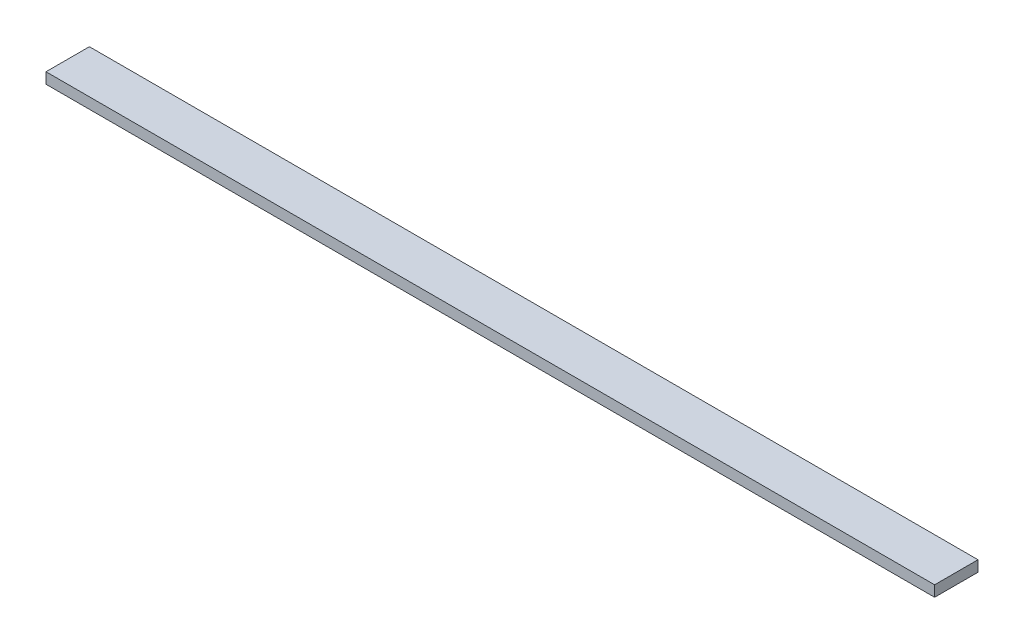
ISO-10303-21;
HEADER;
FILE_DESCRIPTION(('STEP AP214'),'2;1');
FILE_NAME('part.step','',(''),(''),'','','');
FILE_SCHEMA(('AUTOMOTIVE_DESIGN { 1 0 10303 214 1 1 1 1 }'));
ENDSEC;
DATA;
#1=APPLICATION_CONTEXT('core data for automotive mechanical design processes');
#2=APPLICATION_PROTOCOL_DEFINITION('international standard','automotive_design',2000,#1);
#3=PRODUCT_CONTEXT('',#1,'mechanical');
#4=PRODUCT('Part','Part','',(#3));
#5=PRODUCT_RELATED_PRODUCT_CATEGORY('part','',(#4));
#6=PRODUCT_DEFINITION_FORMATION('','',#4);
#7=PRODUCT_DEFINITION_CONTEXT('part definition',#1,'design');
#8=PRODUCT_DEFINITION('design','',#6,#7);
#9=PRODUCT_DEFINITION_SHAPE('','',#8);
#10=(LENGTH_UNIT() NAMED_UNIT(*) SI_UNIT(.MILLI.,.METRE.));
#11=(NAMED_UNIT(*) PLANE_ANGLE_UNIT() SI_UNIT($,.RADIAN.));
#12=(NAMED_UNIT(*) SI_UNIT($,.STERADIAN.) SOLID_ANGLE_UNIT());
#13=UNCERTAINTY_MEASURE_WITH_UNIT(LENGTH_MEASURE(1.E-05),#10,'distance_accuracy_value','');
#14=(GEOMETRIC_REPRESENTATION_CONTEXT(3) GLOBAL_UNCERTAINTY_ASSIGNED_CONTEXT((#13)) GLOBAL_UNIT_ASSIGNED_CONTEXT((#10,
#11,#12)) REPRESENTATION_CONTEXT('',''));
#15=CARTESIAN_POINT('',(0.,0.,0.));
#16=DIRECTION('',(0.,0.,1.));
#17=DIRECTION('',(1.,0.,0.));
#18=AXIS2_PLACEMENT_3D('',#15,#16,#17);
#19=CARTESIAN_POINT('',(0.,3.175,0.));
#20=DIRECTION('',(1.,0.,0.));
#21=DIRECTION('',(0.,0.,-1.));
#22=AXIS2_PLACEMENT_3D('',#19,#20,#21);
#23=PLANE('',#22);
#24=DIRECTION('',(0.,0.,1.));
#25=VECTOR('',#24,1.);
#26=CARTESIAN_POINT('',(0.,0.,0.));
#27=LINE('',#26,#25);
#28=CARTESIAN_POINT('',(0.,0.,-12.7));
#29=VERTEX_POINT('',#28);
#30=CARTESIAN_POINT('',(0.,0.,0.));
#31=VERTEX_POINT('',#30);
#32=EDGE_CURVE('E104',#29,#31,#27,.T.);
#33=ORIENTED_EDGE('',*,*,#32,.T.);
#34=DIRECTION('',(0.,-1.,0.));
#35=VECTOR('',#34,1.);
#36=CARTESIAN_POINT('',(0.,3.175,0.));
#37=LINE('',#36,#35);
#38=CARTESIAN_POINT('',(0.,3.175,0.));
#39=VERTEX_POINT('',#38);
#40=EDGE_CURVE('E11',#39,#31,#37,.T.);
#41=ORIENTED_EDGE('',*,*,#40,.F.);
#42=DIRECTION('',(0.,0.,1.));
#43=VECTOR('',#42,1.);
#44=CARTESIAN_POINT('',(0.,3.175,0.));
#45=LINE('',#44,#43);
#46=CARTESIAN_POINT('',(0.,3.175,-12.7));
#47=VERTEX_POINT('',#46);
#48=EDGE_CURVE('E92',#47,#39,#45,.T.);
#49=ORIENTED_EDGE('',*,*,#48,.F.);
#50=DIRECTION('',(0.,-1.,0.));
#51=VECTOR('',#50,1.);
#52=CARTESIAN_POINT('',(0.,3.175,-12.7));
#53=LINE('',#52,#51);
#54=EDGE_CURVE('E100',#47,#29,#53,.T.);
#55=ORIENTED_EDGE('',*,*,#54,.T.);
#56=EDGE_LOOP('',(#33,#41,#49,#55));
#57=FACE_BOUND('',#56,.T.);
#58=ADVANCED_FACE('F41',(#57),#23,.F.);
#59=CARTESIAN_POINT('',(0.,3.175,0.));
#60=DIRECTION('',(0.,0.,-1.));
#61=DIRECTION('',(-1.,0.,0.));
#62=AXIS2_PLACEMENT_3D('',#59,#60,#61);
#63=PLANE('',#62);
#64=DIRECTION('',(1.,0.,0.));
#65=VECTOR('',#64,1.);
#66=CARTESIAN_POINT('',(0.,0.,0.));
#67=LINE('',#66,#65);
#68=CARTESIAN_POINT('',(260.096,0.,0.));
#69=VERTEX_POINT('',#68);
#70=EDGE_CURVE('E96',#31,#69,#67,.T.);
#71=ORIENTED_EDGE('',*,*,#70,.T.);
#72=DIRECTION('',(0.,-1.,0.));
#73=VECTOR('',#72,1.);
#74=CARTESIAN_POINT('',(260.096,3.175,0.));
#75=LINE('',#74,#73);
#76=CARTESIAN_POINT('',(260.096,3.175,0.));
#77=VERTEX_POINT('',#76);
#78=EDGE_CURVE('E49',#77,#69,#75,.T.);
#79=ORIENTED_EDGE('',*,*,#78,.F.);
#80=DIRECTION('',(1.,0.,0.));
#81=VECTOR('',#80,1.);
#82=CARTESIAN_POINT('',(0.,3.175,0.));
#83=LINE('',#82,#81);
#84=EDGE_CURVE('E87',#39,#77,#83,.T.);
#85=ORIENTED_EDGE('',*,*,#84,.F.);
#86=ORIENTED_EDGE('',*,*,#40,.T.);
#87=EDGE_LOOP('',(#71,#79,#85,#86));
#88=FACE_BOUND('',#87,.T.);
#89=ADVANCED_FACE('F95',(#88),#63,.F.);
#90=CARTESIAN_POINT('',(260.096,3.175,0.));
#91=DIRECTION('',(-1.,0.,0.));
#92=DIRECTION('',(0.,0.,1.));
#93=AXIS2_PLACEMENT_3D('',#90,#91,#92);
#94=PLANE('',#93);
#95=DIRECTION('',(0.,0.,-1.));
#96=VECTOR('',#95,1.);
#97=CARTESIAN_POINT('',(260.096,0.,0.));
#98=LINE('',#97,#96);
#99=CARTESIAN_POINT('',(260.096,0.,-12.7));
#100=VERTEX_POINT('',#99);
#101=EDGE_CURVE('E74',#69,#100,#98,.T.);
#102=ORIENTED_EDGE('',*,*,#101,.T.);
#103=DIRECTION('',(0.,-1.,0.));
#104=VECTOR('',#103,1.);
#105=CARTESIAN_POINT('',(260.096,3.175,-12.7));
#106=LINE('',#105,#104);
#107=CARTESIAN_POINT('',(260.096,3.175,-12.7));
#108=VERTEX_POINT('',#107);
#109=EDGE_CURVE('E97',#108,#100,#106,.T.);
#110=ORIENTED_EDGE('',*,*,#109,.F.);
#111=DIRECTION('',(0.,0.,-1.));
#112=VECTOR('',#111,1.);
#113=CARTESIAN_POINT('',(260.096,3.175,0.));
#114=LINE('',#113,#112);
#115=EDGE_CURVE('E90',#77,#108,#114,.T.);
#116=ORIENTED_EDGE('',*,*,#115,.F.);
#117=ORIENTED_EDGE('',*,*,#78,.T.);
#118=EDGE_LOOP('',(#102,#110,#116,#117));
#119=FACE_BOUND('',#118,.T.);
#120=ADVANCED_FACE('F98',(#119),#94,.F.);
#121=CARTESIAN_POINT('',(0.,3.175,-12.7));
#122=DIRECTION('',(0.,0.,1.));
#123=DIRECTION('',(1.,0.,0.));
#124=AXIS2_PLACEMENT_3D('',#121,#122,#123);
#125=PLANE('',#124);
#126=DIRECTION('',(-1.,0.,0.));
#127=VECTOR('',#126,1.);
#128=CARTESIAN_POINT('',(0.,0.,-12.7));
#129=LINE('',#128,#127);
#130=EDGE_CURVE('E80',#100,#29,#129,.T.);
#131=ORIENTED_EDGE('',*,*,#130,.T.);
#132=ORIENTED_EDGE('',*,*,#54,.F.);
#133=DIRECTION('',(-1.,0.,0.));
#134=VECTOR('',#133,1.);
#135=CARTESIAN_POINT('',(0.,3.175,-12.7));
#136=LINE('',#135,#134);
#137=EDGE_CURVE('E57',#108,#47,#136,.T.);
#138=ORIENTED_EDGE('',*,*,#137,.F.);
#139=ORIENTED_EDGE('',*,*,#109,.T.);
#140=EDGE_LOOP('',(#131,#132,#138,#139));
#141=FACE_BOUND('',#140,.T.);
#142=ADVANCED_FACE('F111',(#141),#125,.F.);
#143=CARTESIAN_POINT('',(0.,3.175,0.));
#144=DIRECTION('',(0.,-1.,0.));
#145=DIRECTION('',(0.,0.,-1.));
#146=AXIS2_PLACEMENT_3D('',#143,#144,#145);
#147=PLANE('',#146);
#148=ORIENTED_EDGE('',*,*,#48,.T.);
#149=ORIENTED_EDGE('',*,*,#84,.T.);
#150=ORIENTED_EDGE('',*,*,#115,.T.);
#151=ORIENTED_EDGE('',*,*,#137,.T.);
#152=EDGE_LOOP('',(#148,#149,#150,#151));
#153=FACE_BOUND('',#152,.T.);
#154=ADVANCED_FACE('F88',(#153),#147,.F.);
#155=CARTESIAN_POINT('',(0.,0.,0.));
#156=DIRECTION('',(0.,-1.,0.));
#157=DIRECTION('',(0.,0.,-1.));
#158=AXIS2_PLACEMENT_3D('',#155,#156,#157);
#159=PLANE('',#158);
#160=ORIENTED_EDGE('',*,*,#32,.F.);
#161=ORIENTED_EDGE('',*,*,#130,.F.);
#162=ORIENTED_EDGE('',*,*,#101,.F.);
#163=ORIENTED_EDGE('',*,*,#70,.F.);
#164=EDGE_LOOP('',(#160,#161,#162,#163));
#165=FACE_BOUND('',#164,.T.);
#166=ADVANCED_FACE('F114',(#165),#159,.T.);
#167=CLOSED_SHELL('',(#58,#89,#120,#142,#154,#166));
#168=MANIFOLD_SOLID_BREP('B2',#167);
#169=ADVANCED_BREP_SHAPE_REPRESENTATION('',(#18,#168),#14);
#170=SHAPE_DEFINITION_REPRESENTATION(#9,#169);
ENDSEC;
END-ISO-10303-21;
